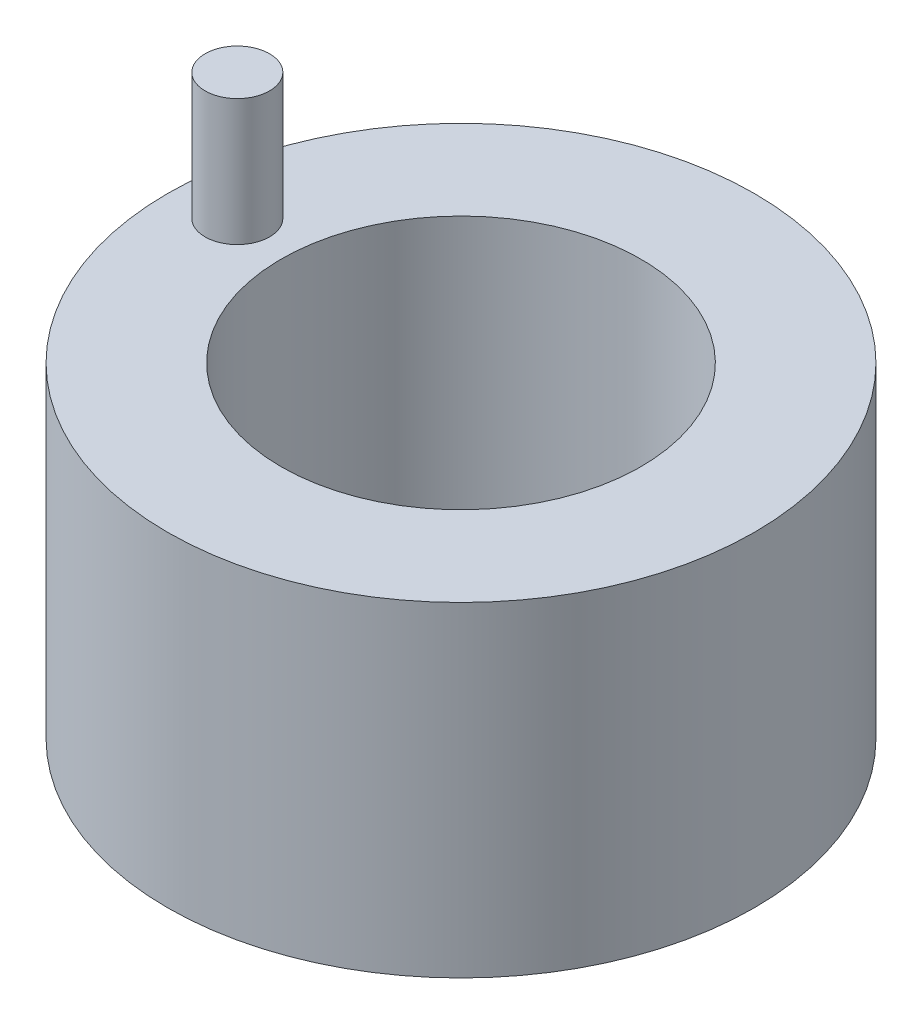
ISO-10303-21;
HEADER;
FILE_DESCRIPTION(('STEP AP214'),'2;1');
FILE_NAME('part.step','',(''),(''),'','','');
FILE_SCHEMA(('AUTOMOTIVE_DESIGN { 1 0 10303 214 1 1 1 1 }'));
ENDSEC;
DATA;
#1=APPLICATION_CONTEXT('core data for automotive mechanical design processes');
#2=APPLICATION_PROTOCOL_DEFINITION('international standard','automotive_design',2000,#1);
#3=PRODUCT_CONTEXT('',#1,'mechanical');
#4=PRODUCT('Part','Part','',(#3));
#5=PRODUCT_RELATED_PRODUCT_CATEGORY('part','',(#4));
#6=PRODUCT_DEFINITION_FORMATION('','',#4);
#7=PRODUCT_DEFINITION_CONTEXT('part definition',#1,'design');
#8=PRODUCT_DEFINITION('design','',#6,#7);
#9=PRODUCT_DEFINITION_SHAPE('','',#8);
#10=(LENGTH_UNIT() NAMED_UNIT(*) SI_UNIT(.MILLI.,.METRE.));
#11=(NAMED_UNIT(*) PLANE_ANGLE_UNIT() SI_UNIT($,.RADIAN.));
#12=(NAMED_UNIT(*) SI_UNIT($,.STERADIAN.) SOLID_ANGLE_UNIT());
#13=UNCERTAINTY_MEASURE_WITH_UNIT(LENGTH_MEASURE(1.E-05),#10,'distance_accuracy_value','');
#14=(GEOMETRIC_REPRESENTATION_CONTEXT(3) GLOBAL_UNCERTAINTY_ASSIGNED_CONTEXT((#13)) GLOBAL_UNIT_ASSIGNED_CONTEXT((#10,
#11,#12)) REPRESENTATION_CONTEXT('',''));
#15=CARTESIAN_POINT('',(0.,0.,0.));
#16=DIRECTION('',(0.,0.,1.));
#17=DIRECTION('',(1.,0.,0.));
#18=AXIS2_PLACEMENT_3D('',#15,#16,#17);
#19=CARTESIAN_POINT('',(0.,72.,0.));
#20=DIRECTION('',(0.,-1.,0.));
#21=DIRECTION('',(0.,0.,-1.));
#22=AXIS2_PLACEMENT_3D('',#19,#20,#21);
#23=CYLINDRICAL_SURFACE('',#22,64.9648911188723);
#24=CARTESIAN_POINT('',(0.,72.,0.));
#25=DIRECTION('',(0.,1.,0.));
#26=DIRECTION('',(0.,0.,1.));
#27=AXIS2_PLACEMENT_3D('',#24,#25,#26);
#28=CIRCLE('',#27,64.9648911188723);
#29=CARTESIAN_POINT('',(0.,72.,64.9648911188723));
#30=VERTEX_POINT('',#29);
#31=EDGE_CURVE('E10',#30,#30,#28,.T.);
#32=ORIENTED_EDGE('',*,*,#31,.F.);
#33=EDGE_LOOP('',(#32));
#34=FACE_BOUND('',#33,.T.);
#35=CARTESIAN_POINT('',(0.,0.,0.));
#36=DIRECTION('',(0.,1.,0.));
#37=DIRECTION('',(0.,0.,1.));
#38=AXIS2_PLACEMENT_3D('',#35,#36,#37);
#39=CIRCLE('',#38,64.9648911188723);
#40=CARTESIAN_POINT('',(0.,0.,64.9648911188723));
#41=VERTEX_POINT('',#40);
#42=EDGE_CURVE('E34',#41,#41,#39,.T.);
#43=ORIENTED_EDGE('',*,*,#42,.T.);
#44=EDGE_LOOP('',(#43));
#45=FACE_BOUND('',#44,.T.);
#46=ADVANCED_FACE('F31',(#34,#45),#23,.T.);
#47=CARTESIAN_POINT('',(0.,72.,0.));
#48=DIRECTION('',(0.,1.,0.));
#49=DIRECTION('',(0.,0.,1.));
#50=AXIS2_PLACEMENT_3D('',#47,#48,#49);
#51=PLANE('',#50);
#52=CARTESIAN_POINT('',(-52.4781673059086,72.,-2.9565798554182));
#53=DIRECTION('',(0.,1.,0.));
#54=DIRECTION('',(0.,0.,1.));
#55=AXIS2_PLACEMENT_3D('',#52,#53,#54);
#56=CIRCLE('',#55,7.13269556255075);
#57=CARTESIAN_POINT('',(-52.4781673059086,72.,4.17611570713254));
#58=VERTEX_POINT('',#57);
#59=EDGE_CURVE('E49',#58,#58,#56,.T.);
#60=ORIENTED_EDGE('',*,*,#59,.F.);
#61=EDGE_LOOP('',(#60));
#62=FACE_BOUND('',#61,.T.);
#63=CARTESIAN_POINT('',(0.,72.,0.));
#64=DIRECTION('',(0.,1.,0.));
#65=DIRECTION('',(0.,0.,1.));
#66=AXIS2_PLACEMENT_3D('',#63,#64,#65);
#67=CIRCLE('',#66,39.8268698171005);
#68=CARTESIAN_POINT('',(0.,72.,39.8268698171005));
#69=VERTEX_POINT('',#68);
#70=EDGE_CURVE('E43',#69,#69,#67,.T.);
#71=ORIENTED_EDGE('',*,*,#70,.F.);
#72=EDGE_LOOP('',(#71));
#73=FACE_BOUND('',#72,.T.);
#74=ORIENTED_EDGE('',*,*,#31,.T.);
#75=EDGE_LOOP('',(#74));
#76=FACE_BOUND('',#75,.T.);
#77=ADVANCED_FACE('F64',(#62,#73,#76),#51,.T.);
#78=CARTESIAN_POINT('',(0.,0.,0.));
#79=DIRECTION('',(0.,1.,0.));
#80=DIRECTION('',(0.,0.,1.));
#81=AXIS2_PLACEMENT_3D('',#78,#79,#80);
#82=PLANE('',#81);
#83=CARTESIAN_POINT('',(0.,0.,0.));
#84=DIRECTION('',(0.,1.,0.));
#85=DIRECTION('',(0.,0.,1.));
#86=AXIS2_PLACEMENT_3D('',#83,#84,#85);
#87=CIRCLE('',#86,39.8268698171005);
#88=CARTESIAN_POINT('',(0.,0.,39.8268698171005));
#89=VERTEX_POINT('',#88);
#90=EDGE_CURVE('E41',#89,#89,#87,.T.);
#91=ORIENTED_EDGE('',*,*,#90,.T.);
#92=EDGE_LOOP('',(#91));
#93=FACE_BOUND('',#92,.T.);
#94=ORIENTED_EDGE('',*,*,#42,.F.);
#95=EDGE_LOOP('',(#94));
#96=FACE_BOUND('',#95,.T.);
#97=ADVANCED_FACE('F67',(#93,#96),#82,.F.);
#98=CARTESIAN_POINT('',(0.,0.,0.));
#99=DIRECTION('',(0.,1.,0.));
#100=DIRECTION('',(0.,0.,1.));
#101=AXIS2_PLACEMENT_3D('',#98,#99,#100);
#102=CYLINDRICAL_SURFACE('',#101,39.8268698171005);
#103=ORIENTED_EDGE('',*,*,#90,.F.);
#104=EDGE_LOOP('',(#103));
#105=FACE_BOUND('',#104,.T.);
#106=ORIENTED_EDGE('',*,*,#70,.T.);
#107=EDGE_LOOP('',(#106));
#108=FACE_BOUND('',#107,.T.);
#109=ADVANCED_FACE('F60',(#105,#108),#102,.F.);
#110=CARTESIAN_POINT('',(-52.4781673059086,100.,-2.9565798554182));
#111=DIRECTION('',(0.,-1.,0.));
#112=DIRECTION('',(0.,0.,-1.));
#113=AXIS2_PLACEMENT_3D('',#110,#111,#112);
#114=CYLINDRICAL_SURFACE('',#113,7.13269556255075);
#115=CARTESIAN_POINT('',(-52.4781673059086,100.,-2.9565798554182));
#116=DIRECTION('',(0.,1.,0.));
#117=DIRECTION('',(0.,0.,1.));
#118=AXIS2_PLACEMENT_3D('',#115,#116,#117);
#119=CIRCLE('',#118,7.13269556255075);
#120=CARTESIAN_POINT('',(-52.4781673059086,100.,4.17611570713254));
#121=VERTEX_POINT('',#120);
#122=EDGE_CURVE('E46',#121,#121,#119,.T.);
#123=ORIENTED_EDGE('',*,*,#122,.F.);
#124=EDGE_LOOP('',(#123));
#125=FACE_BOUND('',#124,.T.);
#126=ORIENTED_EDGE('',*,*,#59,.T.);
#127=EDGE_LOOP('',(#126));
#128=FACE_BOUND('',#127,.T.);
#129=ADVANCED_FACE('F57',(#125,#128),#114,.T.);
#130=CARTESIAN_POINT('',(-52.4781673059086,100.,-2.9565798554182));
#131=DIRECTION('',(0.,1.,0.));
#132=DIRECTION('',(0.,0.,1.));
#133=AXIS2_PLACEMENT_3D('',#130,#131,#132);
#134=PLANE('',#133);
#135=ORIENTED_EDGE('',*,*,#122,.T.);
#136=EDGE_LOOP('',(#135));
#137=FACE_BOUND('',#136,.T.);
#138=ADVANCED_FACE('F55',(#137),#134,.T.);
#139=CLOSED_SHELL('',(#46,#77,#97,#109,#129,#138));
#140=MANIFOLD_SOLID_BREP('B2',#139);
#141=ADVANCED_BREP_SHAPE_REPRESENTATION('',(#18,#140),#14);
#142=SHAPE_DEFINITION_REPRESENTATION(#9,#141);
ENDSEC;
END-ISO-10303-21;
